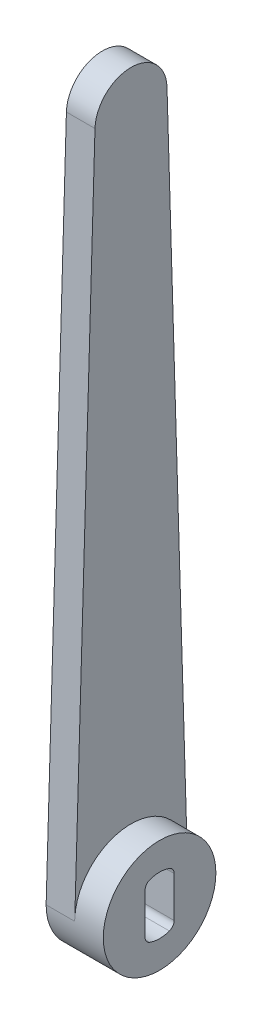
ISO-10303-21;
HEADER;
FILE_DESCRIPTION(('STEP AP214'),'2;1');
FILE_NAME('part.step','',(''),(''),'','','');
FILE_SCHEMA(('AUTOMOTIVE_DESIGN { 1 0 10303 214 1 1 1 1 }'));
ENDSEC;
DATA;
#1=APPLICATION_CONTEXT('core data for automotive mechanical design processes');
#2=APPLICATION_PROTOCOL_DEFINITION('international standard','automotive_design',2000,#1);
#3=PRODUCT_CONTEXT('',#1,'mechanical');
#4=PRODUCT('Part','Part','',(#3));
#5=PRODUCT_RELATED_PRODUCT_CATEGORY('part','',(#4));
#6=PRODUCT_DEFINITION_FORMATION('','',#4);
#7=PRODUCT_DEFINITION_CONTEXT('part definition',#1,'design');
#8=PRODUCT_DEFINITION('design','',#6,#7);
#9=PRODUCT_DEFINITION_SHAPE('','',#8);
#10=(LENGTH_UNIT() NAMED_UNIT(*) SI_UNIT(.MILLI.,.METRE.));
#11=(NAMED_UNIT(*) PLANE_ANGLE_UNIT() SI_UNIT($,.RADIAN.));
#12=(NAMED_UNIT(*) SI_UNIT($,.STERADIAN.) SOLID_ANGLE_UNIT());
#13=UNCERTAINTY_MEASURE_WITH_UNIT(LENGTH_MEASURE(1.E-05),#10,'distance_accuracy_value','');
#14=(GEOMETRIC_REPRESENTATION_CONTEXT(3) GLOBAL_UNCERTAINTY_ASSIGNED_CONTEXT((#13)) GLOBAL_UNIT_ASSIGNED_CONTEXT((#10,
#11,#12)) REPRESENTATION_CONTEXT('',''));
#15=CARTESIAN_POINT('',(0.,0.,0.));
#16=DIRECTION('',(0.,0.,1.));
#17=DIRECTION('',(1.,0.,0.));
#18=AXIS2_PLACEMENT_3D('',#15,#16,#17);
#19=CARTESIAN_POINT('',(6.35,0.,0.));
#20=DIRECTION('',(-1.,0.,0.));
#21=DIRECTION('',(0.,0.,1.));
#22=AXIS2_PLACEMENT_3D('',#19,#20,#21);
#23=CYLINDRICAL_SURFACE('',#22,12.5);
#24=CARTESIAN_POINT('',(0.,0.,0.));
#25=DIRECTION('',(1.,0.,0.));
#26=DIRECTION('',(0.,0.,-1.));
#27=AXIS2_PLACEMENT_3D('',#24,#25,#26);
#28=CIRCLE('',#27,12.5);
#29=CARTESIAN_POINT('',(0.,0.,12.5));
#30=VERTEX_POINT('',#29);
#31=CARTESIAN_POINT('',(0.,0.375,-12.4943737338052));
#32=VERTEX_POINT('',#31);
#33=EDGE_CURVE('E133',#30,#32,#28,.T.);
#34=ORIENTED_EDGE('',*,*,#33,.T.);
#35=DIRECTION('',(-1.,0.,0.));
#36=VECTOR('',#35,1.);
#37=CARTESIAN_POINT('',(6.35,0.375,-12.4943737338052));
#38=LINE('',#37,#36);
#39=CARTESIAN_POINT('',(6.35,0.375,-12.4943737338052));
#40=VERTEX_POINT('',#39);
#41=EDGE_CURVE('E125',#40,#32,#38,.T.);
#42=ORIENTED_EDGE('',*,*,#41,.F.);
#43=CARTESIAN_POINT('',(6.35,0.,0.));
#44=DIRECTION('',(1.,0.,0.));
#45=DIRECTION('',(0.,0.,-1.));
#46=AXIS2_PLACEMENT_3D('',#43,#44,#45);
#47=CIRCLE('',#46,12.5);
#48=CARTESIAN_POINT('',(6.35,0.748728312673256,12.4775560873835));
#49=VERTEX_POINT('',#48);
#50=EDGE_CURVE('E130',#40,#49,#47,.T.);
#51=ORIENTED_EDGE('',*,*,#50,.T.);
#52=CARTESIAN_POINT('',(6.35,0.,0.));
#53=DIRECTION('',(1.,0.,0.));
#54=DIRECTION('',(0.,0.0598982650138606,0.998204486990681));
#55=AXIS2_PLACEMENT_3D('',#52,#53,#54);
#56=CIRCLE('',#55,12.5);
#57=CARTESIAN_POINT('',(6.35,0.,12.5));
#58=VERTEX_POINT('',#57);
#59=EDGE_CURVE('E168',#49,#58,#56,.T.);
#60=ORIENTED_EDGE('',*,*,#59,.T.);
#61=DIRECTION('',(-1.,0.,0.));
#62=VECTOR('',#61,1.);
#63=CARTESIAN_POINT('',(6.35,0.,12.5));
#64=LINE('',#63,#62);
#65=EDGE_CURVE('E406',#58,#30,#64,.T.);
#66=ORIENTED_EDGE('',*,*,#65,.T.);
#67=EDGE_LOOP('',(#34,#42,#51,#60,#66));
#68=FACE_BOUND('',#67,.T.);
#69=CARTESIAN_POINT('',(12.7,0.,0.));
#70=DIRECTION('',(1.,0.,0.));
#71=DIRECTION('',(0.,0.,-1.));
#72=AXIS2_PLACEMENT_3D('',#69,#70,#71);
#73=CIRCLE('',#72,12.5);
#74=CARTESIAN_POINT('',(12.7,0.,-12.5));
#75=VERTEX_POINT('',#74);
#76=EDGE_CURVE('E151',#75,#75,#73,.T.);
#77=ORIENTED_EDGE('',*,*,#76,.F.);
#78=EDGE_LOOP('',(#77));
#79=FACE_BOUND('',#78,.T.);
#80=ADVANCED_FACE('F32',(#68,#79),#23,.T.);
#81=CARTESIAN_POINT('',(6.35,0.375,-12.4943737338052));
#82=DIRECTION('',(0.,-0.03,0.999549898704412));
#83=DIRECTION('',(0.,-0.999549898704412,-0.03));
#84=AXIS2_PLACEMENT_3D('',#81,#82,#83);
#85=PLANE('',#84);
#86=DIRECTION('',(0.,0.999549898704412,0.03));
#87=VECTOR('',#86,1.);
#88=CARTESIAN_POINT('',(0.,0.375,-12.4943737338052));
#89=LINE('',#88,#87);
#90=CARTESIAN_POINT('',(0.,150.24,-7.99639918963529));
#91=VERTEX_POINT('',#90);
#92=EDGE_CURVE('E399',#32,#91,#89,.T.);
#93=ORIENTED_EDGE('',*,*,#92,.T.);
#94=DIRECTION('',(-1.,0.,0.));
#95=VECTOR('',#94,1.);
#96=CARTESIAN_POINT('',(6.35,150.24,-7.99639918963529));
#97=LINE('',#96,#95);
#98=CARTESIAN_POINT('',(6.35,150.24,-7.99639918963529));
#99=VERTEX_POINT('',#98);
#100=EDGE_CURVE('E136',#99,#91,#97,.T.);
#101=ORIENTED_EDGE('',*,*,#100,.F.);
#102=DIRECTION('',(0.,0.999549898704412,0.03));
#103=VECTOR('',#102,1.);
#104=CARTESIAN_POINT('',(6.35,0.375,-12.4943737338052));
#105=LINE('',#104,#103);
#106=EDGE_CURVE('E139',#40,#99,#105,.T.);
#107=ORIENTED_EDGE('',*,*,#106,.F.);
#108=ORIENTED_EDGE('',*,*,#41,.T.);
#109=EDGE_LOOP('',(#93,#101,#107,#108));
#110=FACE_BOUND('',#109,.T.);
#111=ADVANCED_FACE('F140',(#110),#85,.F.);
#112=CARTESIAN_POINT('',(6.35,150.,0.));
#113=DIRECTION('',(-1.,0.,0.));
#114=DIRECTION('',(0.,0.,1.));
#115=AXIS2_PLACEMENT_3D('',#112,#113,#114);
#116=CYLINDRICAL_SURFACE('',#115,8.);
#117=CARTESIAN_POINT('',(0.,150.,0.));
#118=DIRECTION('',(1.,0.,0.));
#119=DIRECTION('',(0.,0.,-1.));
#120=AXIS2_PLACEMENT_3D('',#117,#118,#119);
#121=CIRCLE('',#120,8.);
#122=CARTESIAN_POINT('',(0.,150.239700680638,7.99640816765264));
#123=VERTEX_POINT('',#122);
#124=EDGE_CURVE('E400',#91,#123,#121,.T.);
#125=ORIENTED_EDGE('',*,*,#124,.T.);
#126=DIRECTION('',(-1.,0.,0.));
#127=VECTOR('',#126,1.);
#128=CARTESIAN_POINT('',(6.35,150.239700680638,7.99640816765264));
#129=LINE('',#128,#127);
#130=CARTESIAN_POINT('',(6.35,150.239700680638,7.99640816765264));
#131=VERTEX_POINT('',#130);
#132=EDGE_CURVE('E404',#131,#123,#129,.T.);
#133=ORIENTED_EDGE('',*,*,#132,.F.);
#134=CARTESIAN_POINT('',(6.35,150.,0.));
#135=DIRECTION('',(1.,0.,0.));
#136=DIRECTION('',(0.,0.,-1.));
#137=AXIS2_PLACEMENT_3D('',#134,#135,#136);
#138=CIRCLE('',#137,8.);
#139=EDGE_CURVE('E144',#99,#131,#138,.T.);
#140=ORIENTED_EDGE('',*,*,#139,.F.);
#141=ORIENTED_EDGE('',*,*,#100,.T.);
#142=EDGE_LOOP('',(#125,#133,#140,#141));
#143=FACE_BOUND('',#142,.T.);
#144=ADVANCED_FACE('F184',(#143),#116,.T.);
#145=CARTESIAN_POINT('',(6.35,0.,12.5));
#146=DIRECTION('',(0.,-0.029962585079715,-0.99955102095658));
#147=DIRECTION('',(0.,0.99955102095658,-0.029962585079715));
#148=AXIS2_PLACEMENT_3D('',#145,#146,#147);
#149=PLANE('',#148);
#150=DIRECTION('',(0.,-0.99955102095658,0.029962585079715));
#151=VECTOR('',#150,1.);
#152=CARTESIAN_POINT('',(0.,0.,12.5));
#153=LINE('',#152,#151);
#154=EDGE_CURVE('E145',#123,#30,#153,.T.);
#155=ORIENTED_EDGE('',*,*,#154,.T.);
#156=ORIENTED_EDGE('',*,*,#65,.F.);
#157=ORIENTED_EDGE('',*,*,#59,.F.);
#158=DIRECTION('',(0.,-0.99955102095658,0.029962585079715));
#159=VECTOR('',#158,1.);
#160=CARTESIAN_POINT('',(6.35,0.,12.5));
#161=LINE('',#160,#159);
#162=EDGE_CURVE('E150',#131,#49,#161,.T.);
#163=ORIENTED_EDGE('',*,*,#162,.F.);
#164=ORIENTED_EDGE('',*,*,#132,.T.);
#165=EDGE_LOOP('',(#155,#156,#157,#163,#164));
#166=FACE_BOUND('',#165,.T.);
#167=ADVANCED_FACE('F174',(#166),#149,.F.);
#168=CARTESIAN_POINT('',(6.35,0.,0.));
#169=DIRECTION('',(1.,0.,0.));
#170=DIRECTION('',(0.,0.,-1.));
#171=AXIS2_PLACEMENT_3D('',#168,#169,#170);
#172=PLANE('',#171);
#173=ORIENTED_EDGE('',*,*,#50,.F.);
#174=ORIENTED_EDGE('',*,*,#106,.T.);
#175=ORIENTED_EDGE('',*,*,#139,.T.);
#176=ORIENTED_EDGE('',*,*,#162,.T.);
#177=EDGE_LOOP('',(#173,#174,#175,#176));
#178=FACE_BOUND('',#177,.T.);
#179=ADVANCED_FACE('F148',(#178),#172,.T.);
#180=CARTESIAN_POINT('',(0.,0.,0.));
#181=DIRECTION('',(1.,0.,0.));
#182=DIRECTION('',(0.,0.,-1.));
#183=AXIS2_PLACEMENT_3D('',#180,#181,#182);
#184=PLANE('',#183);
#185=CARTESIAN_POINT('',(0.,0.,0.));
#186=DIRECTION('',(1.,0.,0.));
#187=DIRECTION('',(0.,0.,-1.));
#188=AXIS2_PLACEMENT_3D('',#185,#186,#187);
#189=CIRCLE('',#188,6.4008);
#190=CARTESIAN_POINT('',(0.,-6.01861977749129,2.1786364116095));
#191=VERTEX_POINT('',#190);
#192=CARTESIAN_POINT('',(0.,-6.01861977749129,-2.1786364116095));
#193=VERTEX_POINT('',#192);
#194=EDGE_CURVE('E211',#191,#193,#189,.T.);
#195=ORIENTED_EDGE('',*,*,#194,.T.);
#196=CARTESIAN_POINT('',(0.,-4.52590653902619,-1.6383));
#197=DIRECTION('',(1.,0.,0.));
#198=DIRECTION('',(0.,0.,-1.));
#199=AXIS2_PLACEMENT_3D('',#196,#197,#198);
#200=CIRCLE('',#199,1.5875);
#201=CARTESIAN_POINT('',(0.,-4.52590653902619,-3.2258));
#202=VERTEX_POINT('',#201);
#203=EDGE_CURVE('E240',#193,#202,#200,.T.);
#204=ORIENTED_EDGE('',*,*,#203,.T.);
#205=DIRECTION('',(0.,1.,0.));
#206=VECTOR('',#205,1.);
#207=CARTESIAN_POINT('',(0.,0.,-3.2258));
#208=LINE('',#207,#206);
#209=CARTESIAN_POINT('',(0.,4.52590653902619,-3.2258));
#210=VERTEX_POINT('',#209);
#211=EDGE_CURVE('E156',#202,#210,#208,.T.);
#212=ORIENTED_EDGE('',*,*,#211,.T.);
#213=CARTESIAN_POINT('',(0.,4.52590653902619,-1.6383));
#214=DIRECTION('',(1.,0.,0.));
#215=DIRECTION('',(0.,0.,-1.));
#216=AXIS2_PLACEMENT_3D('',#213,#214,#215);
#217=CIRCLE('',#216,1.5875);
#218=CARTESIAN_POINT('',(0.,6.01861977749129,-2.1786364116095));
#219=VERTEX_POINT('',#218);
#220=EDGE_CURVE('E11',#210,#219,#217,.T.);
#221=ORIENTED_EDGE('',*,*,#220,.T.);
#222=CARTESIAN_POINT('',(0.,0.,0.));
#223=DIRECTION('',(1.,0.,0.));
#224=DIRECTION('',(0.,0.,-1.));
#225=AXIS2_PLACEMENT_3D('',#222,#223,#224);
#226=CIRCLE('',#225,6.4008);
#227=CARTESIAN_POINT('',(0.,6.01861977749129,2.1786364116095));
#228=VERTEX_POINT('',#227);
#229=EDGE_CURVE('E152',#219,#228,#226,.T.);
#230=ORIENTED_EDGE('',*,*,#229,.T.);
#231=CARTESIAN_POINT('',(0.,4.52590653902619,1.6383));
#232=DIRECTION('',(1.,0.,0.));
#233=DIRECTION('',(0.,0.,-1.));
#234=AXIS2_PLACEMENT_3D('',#231,#232,#233);
#235=CIRCLE('',#234,1.5875);
#236=CARTESIAN_POINT('',(0.,4.52590653902619,3.2258));
#237=VERTEX_POINT('',#236);
#238=EDGE_CURVE('E244',#228,#237,#235,.T.);
#239=ORIENTED_EDGE('',*,*,#238,.T.);
#240=DIRECTION('',(0.,1.,0.));
#241=VECTOR('',#240,1.);
#242=CARTESIAN_POINT('',(0.,0.,3.2258));
#243=LINE('',#242,#241);
#244=CARTESIAN_POINT('',(0.,-4.52590653902619,3.2258));
#245=VERTEX_POINT('',#244);
#246=EDGE_CURVE('E203',#237,#245,#243,.F.);
#247=ORIENTED_EDGE('',*,*,#246,.T.);
#248=CARTESIAN_POINT('',(0.,-4.52590653902619,1.6383));
#249=DIRECTION('',(1.,0.,0.));
#250=DIRECTION('',(0.,0.,-1.));
#251=AXIS2_PLACEMENT_3D('',#248,#249,#250);
#252=CIRCLE('',#251,1.5875);
#253=EDGE_CURVE('E236',#245,#191,#252,.T.);
#254=ORIENTED_EDGE('',*,*,#253,.T.);
#255=EDGE_LOOP('',(#195,#204,#212,#221,#230,#239,#247,#254));
#256=FACE_BOUND('',#255,.T.);
#257=ORIENTED_EDGE('',*,*,#33,.F.);
#258=ORIENTED_EDGE('',*,*,#154,.F.);
#259=ORIENTED_EDGE('',*,*,#124,.F.);
#260=ORIENTED_EDGE('',*,*,#92,.F.);
#261=EDGE_LOOP('',(#257,#258,#259,#260));
#262=FACE_BOUND('',#261,.T.);
#263=ADVANCED_FACE('F185',(#256,#262),#184,.F.);
#264=CARTESIAN_POINT('',(12.7,0.,0.));
#265=DIRECTION('',(1.,0.,0.));
#266=DIRECTION('',(0.,0.,-1.));
#267=AXIS2_PLACEMENT_3D('',#264,#265,#266);
#268=PLANE('',#267);
#269=CARTESIAN_POINT('',(12.7,0.,0.));
#270=DIRECTION('',(1.,0.,0.));
#271=DIRECTION('',(0.,0.,-1.));
#272=AXIS2_PLACEMENT_3D('',#269,#270,#271);
#273=CIRCLE('',#272,6.4008);
#274=CARTESIAN_POINT('',(12.7,6.01861977749129,-2.1786364116095));
#275=VERTEX_POINT('',#274);
#276=CARTESIAN_POINT('',(12.7,6.01861977749129,2.1786364116095));
#277=VERTEX_POINT('',#276);
#278=EDGE_CURVE('E251',#275,#277,#273,.T.);
#279=ORIENTED_EDGE('',*,*,#278,.F.);
#280=CARTESIAN_POINT('',(12.7,4.52590653902619,-1.6383));
#281=DIRECTION('',(1.,0.,0.));
#282=DIRECTION('',(0.,0.,-1.));
#283=AXIS2_PLACEMENT_3D('',#280,#281,#282);
#284=CIRCLE('',#283,1.5875);
#285=CARTESIAN_POINT('',(12.7,4.52590653902619,-3.2258));
#286=VERTEX_POINT('',#285);
#287=EDGE_CURVE('E40',#275,#286,#284,.F.);
#288=ORIENTED_EDGE('',*,*,#287,.T.);
#289=DIRECTION('',(0.,1.,0.));
#290=VECTOR('',#289,1.);
#291=CARTESIAN_POINT('',(12.7,5.52851291035844,-3.2258));
#292=LINE('',#291,#290);
#293=CARTESIAN_POINT('',(12.7,-4.52590653902619,-3.2258));
#294=VERTEX_POINT('',#293);
#295=EDGE_CURVE('E212',#294,#286,#292,.T.);
#296=ORIENTED_EDGE('',*,*,#295,.F.);
#297=CARTESIAN_POINT('',(12.7,-4.52590653902619,-1.6383));
#298=DIRECTION('',(1.,0.,0.));
#299=DIRECTION('',(0.,0.,-1.));
#300=AXIS2_PLACEMENT_3D('',#297,#298,#299);
#301=CIRCLE('',#300,1.5875);
#302=CARTESIAN_POINT('',(12.7,-6.01861977749129,-2.1786364116095));
#303=VERTEX_POINT('',#302);
#304=EDGE_CURVE('E238',#294,#303,#301,.F.);
#305=ORIENTED_EDGE('',*,*,#304,.T.);
#306=CARTESIAN_POINT('',(12.7,0.,0.));
#307=DIRECTION('',(1.,0.,0.));
#308=DIRECTION('',(0.,0.,-1.));
#309=AXIS2_PLACEMENT_3D('',#306,#307,#308);
#310=CIRCLE('',#309,6.4008);
#311=CARTESIAN_POINT('',(12.7,-6.01861977749129,2.1786364116095));
#312=VERTEX_POINT('',#311);
#313=EDGE_CURVE('E259',#312,#303,#310,.T.);
#314=ORIENTED_EDGE('',*,*,#313,.F.);
#315=CARTESIAN_POINT('',(12.7,-4.52590653902619,1.6383));
#316=DIRECTION('',(1.,0.,0.));
#317=DIRECTION('',(0.,0.,-1.));
#318=AXIS2_PLACEMENT_3D('',#315,#316,#317);
#319=CIRCLE('',#318,1.5875);
#320=CARTESIAN_POINT('',(12.7,-4.52590653902619,3.2258));
#321=VERTEX_POINT('',#320);
#322=EDGE_CURVE('E234',#312,#321,#319,.F.);
#323=ORIENTED_EDGE('',*,*,#322,.T.);
#324=DIRECTION('',(0.,-1.,0.));
#325=VECTOR('',#324,1.);
#326=CARTESIAN_POINT('',(12.7,5.52851291035844,3.2258));
#327=LINE('',#326,#325);
#328=CARTESIAN_POINT('',(12.7,4.52590653902619,3.2258));
#329=VERTEX_POINT('',#328);
#330=EDGE_CURVE('E271',#329,#321,#327,.T.);
#331=ORIENTED_EDGE('',*,*,#330,.F.);
#332=CARTESIAN_POINT('',(12.7,4.52590653902619,1.6383));
#333=DIRECTION('',(1.,0.,0.));
#334=DIRECTION('',(0.,0.,-1.));
#335=AXIS2_PLACEMENT_3D('',#332,#333,#334);
#336=CIRCLE('',#335,1.5875);
#337=EDGE_CURVE('E242',#329,#277,#336,.F.);
#338=ORIENTED_EDGE('',*,*,#337,.T.);
#339=EDGE_LOOP('',(#279,#288,#296,#305,#314,#323,#331,#338));
#340=FACE_BOUND('',#339,.T.);
#341=ORIENTED_EDGE('',*,*,#76,.T.);
#342=EDGE_LOOP('',(#341));
#343=FACE_BOUND('',#342,.T.);
#344=ADVANCED_FACE('F249',(#340,#343),#268,.T.);
#345=CARTESIAN_POINT('',(-2.50000000007189E-05,0.,0.));
#346=DIRECTION('',(1.,0.,0.));
#347=DIRECTION('',(0.,0.,-1.));
#348=AXIS2_PLACEMENT_3D('',#345,#346,#347);
#349=CYLINDRICAL_SURFACE('',#348,6.4008);
#350=ORIENTED_EDGE('',*,*,#278,.T.);
#351=DIRECTION('',(1.,0.,0.));
#352=VECTOR('',#351,1.);
#353=CARTESIAN_POINT('',(-2.50000000007189E-05,6.01861977749129,2.1786364116095));
#354=LINE('',#353,#352);
#355=EDGE_CURVE('E47',#277,#228,#354,.F.);
#356=ORIENTED_EDGE('',*,*,#355,.T.);
#357=ORIENTED_EDGE('',*,*,#229,.F.);
#358=DIRECTION('',(1.,0.,0.));
#359=VECTOR('',#358,1.);
#360=CARTESIAN_POINT('',(-2.50000000007189E-05,6.01861977749129,-2.1786364116095));
#361=LINE('',#360,#359);
#362=EDGE_CURVE('E230',#219,#275,#361,.T.);
#363=ORIENTED_EDGE('',*,*,#362,.T.);
#364=EDGE_LOOP('',(#350,#356,#357,#363));
#365=FACE_BOUND('',#364,.T.);
#366=ADVANCED_FACE('F260',(#365),#349,.F.);
#367=CARTESIAN_POINT('',(-2.50000000007189E-05,5.52851291035844,-3.2258));
#368=DIRECTION('',(0.,0.,-1.));
#369=DIRECTION('',(-1.,0.,0.));
#370=AXIS2_PLACEMENT_3D('',#367,#368,#369);
#371=PLANE('',#370);
#372=ORIENTED_EDGE('',*,*,#211,.F.);
#373=DIRECTION('',(-1.,0.,0.));
#374=VECTOR('',#373,1.);
#375=CARTESIAN_POINT('',(12.7,-4.52590653902619,-3.2258));
#376=LINE('',#375,#374);
#377=EDGE_CURVE('E227',#202,#294,#376,.F.);
#378=ORIENTED_EDGE('',*,*,#377,.T.);
#379=ORIENTED_EDGE('',*,*,#295,.T.);
#380=DIRECTION('',(-1.,0.,0.));
#381=VECTOR('',#380,1.);
#382=CARTESIAN_POINT('',(0.,4.52590653902619,-3.2258));
#383=LINE('',#382,#381);
#384=EDGE_CURVE('E225',#286,#210,#383,.T.);
#385=ORIENTED_EDGE('',*,*,#384,.T.);
#386=EDGE_LOOP('',(#372,#378,#379,#385));
#387=FACE_BOUND('',#386,.T.);
#388=ADVANCED_FACE('F257',(#387),#371,.F.);
#389=CARTESIAN_POINT('',(-2.50000000007189E-05,0.,0.));
#390=DIRECTION('',(1.,0.,0.));
#391=DIRECTION('',(0.,0.,-1.));
#392=AXIS2_PLACEMENT_3D('',#389,#390,#391);
#393=CYLINDRICAL_SURFACE('',#392,6.4008);
#394=ORIENTED_EDGE('',*,*,#194,.F.);
#395=DIRECTION('',(1.,0.,0.));
#396=VECTOR('',#395,1.);
#397=CARTESIAN_POINT('',(-2.50000000007189E-05,-6.01861977749129,2.1786364116095));
#398=LINE('',#397,#396);
#399=EDGE_CURVE('E217',#191,#312,#398,.T.);
#400=ORIENTED_EDGE('',*,*,#399,.T.);
#401=ORIENTED_EDGE('',*,*,#313,.T.);
#402=DIRECTION('',(1.,0.,0.));
#403=VECTOR('',#402,1.);
#404=CARTESIAN_POINT('',(-2.50000000007189E-05,-6.01861977749129,-2.1786364116095));
#405=LINE('',#404,#403);
#406=EDGE_CURVE('E135',#303,#193,#405,.F.);
#407=ORIENTED_EDGE('',*,*,#406,.T.);
#408=EDGE_LOOP('',(#394,#400,#401,#407));
#409=FACE_BOUND('',#408,.T.);
#410=ADVANCED_FACE('F281',(#409),#393,.F.);
#411=CARTESIAN_POINT('',(-2.50000000007189E-05,5.52851291035844,3.2258));
#412=DIRECTION('',(0.,0.,1.));
#413=DIRECTION('',(1.,0.,0.));
#414=AXIS2_PLACEMENT_3D('',#411,#412,#413);
#415=PLANE('',#414);
#416=ORIENTED_EDGE('',*,*,#330,.T.);
#417=DIRECTION('',(-1.,0.,0.));
#418=VECTOR('',#417,1.);
#419=CARTESIAN_POINT('',(0.,-4.52590653902619,3.2258));
#420=LINE('',#419,#418);
#421=EDGE_CURVE('E223',#321,#245,#420,.T.);
#422=ORIENTED_EDGE('',*,*,#421,.T.);
#423=ORIENTED_EDGE('',*,*,#246,.F.);
#424=DIRECTION('',(-1.,0.,0.));
#425=VECTOR('',#424,1.);
#426=CARTESIAN_POINT('',(12.7,4.52590653902619,3.2258));
#427=LINE('',#426,#425);
#428=EDGE_CURVE('E220',#237,#329,#427,.F.);
#429=ORIENTED_EDGE('',*,*,#428,.T.);
#430=EDGE_LOOP('',(#416,#422,#423,#429));
#431=FACE_BOUND('',#430,.T.);
#432=ADVANCED_FACE('F270',(#431),#415,.F.);
#433=CARTESIAN_POINT('',(-2.50000000007189E-05,-4.52590653902619,1.6383));
#434=DIRECTION('',(1.,0.,0.));
#435=DIRECTION('',(0.,0.,-1.));
#436=AXIS2_PLACEMENT_3D('',#433,#434,#435);
#437=CYLINDRICAL_SURFACE('',#436,1.5875);
#438=ORIENTED_EDGE('',*,*,#253,.F.);
#439=ORIENTED_EDGE('',*,*,#421,.F.);
#440=ORIENTED_EDGE('',*,*,#322,.F.);
#441=ORIENTED_EDGE('',*,*,#399,.F.);
#442=EDGE_LOOP('',(#438,#439,#440,#441));
#443=FACE_BOUND('',#442,.T.);
#444=ADVANCED_FACE('F195',(#443),#437,.F.);
#445=CARTESIAN_POINT('',(-2.50000000007189E-05,-4.52590653902619,-1.6383));
#446=DIRECTION('',(1.,0.,0.));
#447=DIRECTION('',(0.,0.,-1.));
#448=AXIS2_PLACEMENT_3D('',#445,#446,#447);
#449=CYLINDRICAL_SURFACE('',#448,1.5875);
#450=ORIENTED_EDGE('',*,*,#203,.F.);
#451=ORIENTED_EDGE('',*,*,#406,.F.);
#452=ORIENTED_EDGE('',*,*,#304,.F.);
#453=ORIENTED_EDGE('',*,*,#377,.F.);
#454=EDGE_LOOP('',(#450,#451,#452,#453));
#455=FACE_BOUND('',#454,.T.);
#456=ADVANCED_FACE('F285',(#455),#449,.F.);
#457=CARTESIAN_POINT('',(-2.50000000007189E-05,4.52590653902619,1.6383));
#458=DIRECTION('',(1.,0.,0.));
#459=DIRECTION('',(0.,0.,-1.));
#460=AXIS2_PLACEMENT_3D('',#457,#458,#459);
#461=CYLINDRICAL_SURFACE('',#460,1.5875);
#462=ORIENTED_EDGE('',*,*,#238,.F.);
#463=ORIENTED_EDGE('',*,*,#355,.F.);
#464=ORIENTED_EDGE('',*,*,#337,.F.);
#465=ORIENTED_EDGE('',*,*,#428,.F.);
#466=EDGE_LOOP('',(#462,#463,#464,#465));
#467=FACE_BOUND('',#466,.T.);
#468=ADVANCED_FACE('F266',(#467),#461,.F.);
#469=CARTESIAN_POINT('',(-2.50000000007189E-05,4.52590653902619,-1.6383));
#470=DIRECTION('',(1.,0.,0.));
#471=DIRECTION('',(0.,0.,-1.));
#472=AXIS2_PLACEMENT_3D('',#469,#470,#471);
#473=CYLINDRICAL_SURFACE('',#472,1.5875);
#474=ORIENTED_EDGE('',*,*,#220,.F.);
#475=ORIENTED_EDGE('',*,*,#384,.F.);
#476=ORIENTED_EDGE('',*,*,#287,.F.);
#477=ORIENTED_EDGE('',*,*,#362,.F.);
#478=EDGE_LOOP('',(#474,#475,#476,#477));
#479=FACE_BOUND('',#478,.T.);
#480=ADVANCED_FACE('F34',(#479),#473,.F.);
#481=CLOSED_SHELL('',(#80,#111,#144,#167,#179,#263,#344,#366,#388,#410,#432,#444,#456,#468,#480));
#482=MANIFOLD_SOLID_BREP('B2',#481);
#483=ADVANCED_BREP_SHAPE_REPRESENTATION('',(#18,#482),#14);
#484=SHAPE_DEFINITION_REPRESENTATION(#9,#483);
ENDSEC;
END-ISO-10303-21;
